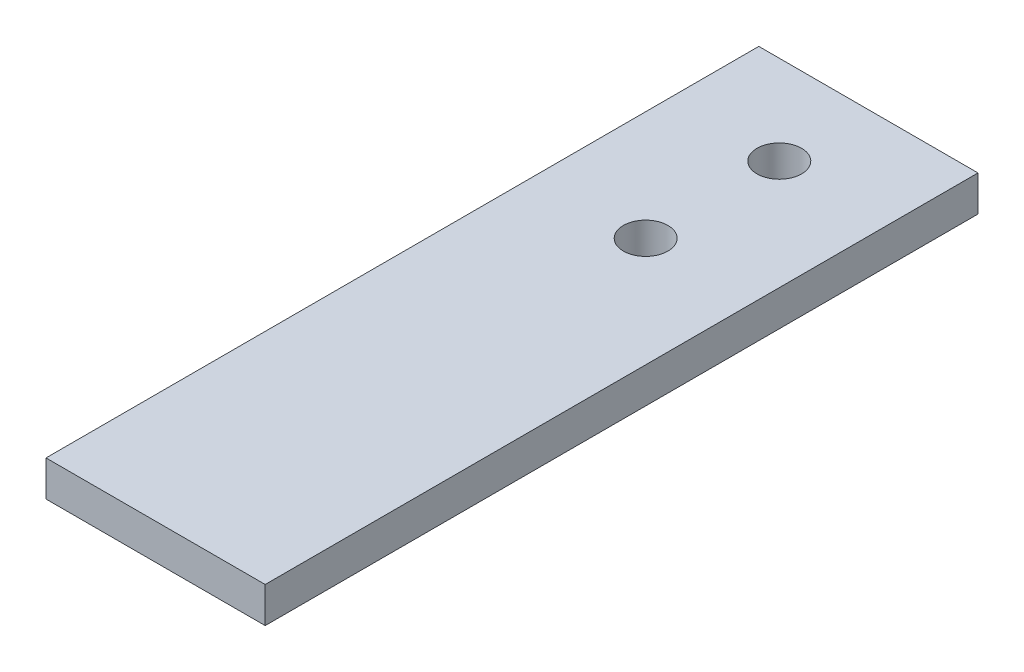
ISO-10303-21;
HEADER;
FILE_DESCRIPTION(('STEP AP214'),'2;1');
FILE_NAME('part.step','',(''),(''),'','','');
FILE_SCHEMA(('AUTOMOTIVE_DESIGN { 1 0 10303 214 1 1 1 1 }'));
ENDSEC;
DATA;
#1=APPLICATION_CONTEXT('core data for automotive mechanical design processes');
#2=APPLICATION_PROTOCOL_DEFINITION('international standard','automotive_design',2000,#1);
#3=PRODUCT_CONTEXT('',#1,'mechanical');
#4=PRODUCT('Part','Part','',(#3));
#5=PRODUCT_RELATED_PRODUCT_CATEGORY('part','',(#4));
#6=PRODUCT_DEFINITION_FORMATION('','',#4);
#7=PRODUCT_DEFINITION_CONTEXT('part definition',#1,'design');
#8=PRODUCT_DEFINITION('design','',#6,#7);
#9=PRODUCT_DEFINITION_SHAPE('','',#8);
#10=(LENGTH_UNIT() NAMED_UNIT(*) SI_UNIT(.MILLI.,.METRE.));
#11=(NAMED_UNIT(*) PLANE_ANGLE_UNIT() SI_UNIT($,.RADIAN.));
#12=(NAMED_UNIT(*) SI_UNIT($,.STERADIAN.) SOLID_ANGLE_UNIT());
#13=UNCERTAINTY_MEASURE_WITH_UNIT(LENGTH_MEASURE(1.E-05),#10,'distance_accuracy_value','');
#14=(GEOMETRIC_REPRESENTATION_CONTEXT(3) GLOBAL_UNCERTAINTY_ASSIGNED_CONTEXT((#13)) GLOBAL_UNIT_ASSIGNED_CONTEXT((#10,
#11,#12)) REPRESENTATION_CONTEXT('',''));
#15=CARTESIAN_POINT('',(0.,0.,0.));
#16=DIRECTION('',(0.,0.,1.));
#17=DIRECTION('',(1.,0.,0.));
#18=AXIS2_PLACEMENT_3D('',#15,#16,#17);
#19=CARTESIAN_POINT('',(0.,5.08,0.));
#20=DIRECTION('',(1.,0.,0.));
#21=DIRECTION('',(0.,0.,-1.));
#22=AXIS2_PLACEMENT_3D('',#19,#20,#21);
#23=PLANE('',#22);
#24=DIRECTION('',(0.,0.,1.));
#25=VECTOR('',#24,1.);
#26=CARTESIAN_POINT('',(0.,0.,0.));
#27=LINE('',#26,#25);
#28=CARTESIAN_POINT('',(0.,0.,-101.6));
#29=VERTEX_POINT('',#28);
#30=CARTESIAN_POINT('',(0.,0.,0.));
#31=VERTEX_POINT('',#30);
#32=EDGE_CURVE('E111',#29,#31,#27,.T.);
#33=ORIENTED_EDGE('',*,*,#32,.T.);
#34=DIRECTION('',(0.,-1.,0.));
#35=VECTOR('',#34,1.);
#36=CARTESIAN_POINT('',(0.,5.08,0.));
#37=LINE('',#36,#35);
#38=CARTESIAN_POINT('',(0.,5.08,0.));
#39=VERTEX_POINT('',#38);
#40=EDGE_CURVE('E11',#39,#31,#37,.T.);
#41=ORIENTED_EDGE('',*,*,#40,.F.);
#42=DIRECTION('',(0.,0.,1.));
#43=VECTOR('',#42,1.);
#44=CARTESIAN_POINT('',(0.,5.08,0.));
#45=LINE('',#44,#43);
#46=CARTESIAN_POINT('',(0.,5.08,-101.6));
#47=VERTEX_POINT('',#46);
#48=EDGE_CURVE('E95',#47,#39,#45,.T.);
#49=ORIENTED_EDGE('',*,*,#48,.F.);
#50=DIRECTION('',(0.,-1.,0.));
#51=VECTOR('',#50,1.);
#52=CARTESIAN_POINT('',(0.,5.08,-101.6));
#53=LINE('',#52,#51);
#54=EDGE_CURVE('E107',#47,#29,#53,.T.);
#55=ORIENTED_EDGE('',*,*,#54,.T.);
#56=EDGE_LOOP('',(#33,#41,#49,#55));
#57=FACE_BOUND('',#56,.T.);
#58=ADVANCED_FACE('F43',(#57),#23,.F.);
#59=CARTESIAN_POINT('',(0.,5.08,0.));
#60=DIRECTION('',(0.,0.,-1.));
#61=DIRECTION('',(-1.,0.,0.));
#62=AXIS2_PLACEMENT_3D('',#59,#60,#61);
#63=PLANE('',#62);
#64=DIRECTION('',(1.,0.,0.));
#65=VECTOR('',#64,1.);
#66=CARTESIAN_POINT('',(0.,0.,0.));
#67=LINE('',#66,#65);
#68=CARTESIAN_POINT('',(31.242,0.,0.));
#69=VERTEX_POINT('',#68);
#70=EDGE_CURVE('E100',#31,#69,#67,.T.);
#71=ORIENTED_EDGE('',*,*,#70,.T.);
#72=DIRECTION('',(0.,-1.,0.));
#73=VECTOR('',#72,1.);
#74=CARTESIAN_POINT('',(31.242,5.08,0.));
#75=LINE('',#74,#73);
#76=CARTESIAN_POINT('',(31.242,5.08,0.));
#77=VERTEX_POINT('',#76);
#78=EDGE_CURVE('E52',#77,#69,#75,.T.);
#79=ORIENTED_EDGE('',*,*,#78,.F.);
#80=DIRECTION('',(1.,0.,0.));
#81=VECTOR('',#80,1.);
#82=CARTESIAN_POINT('',(0.,5.08,0.));
#83=LINE('',#82,#81);
#84=EDGE_CURVE('E90',#39,#77,#83,.T.);
#85=ORIENTED_EDGE('',*,*,#84,.F.);
#86=ORIENTED_EDGE('',*,*,#40,.T.);
#87=EDGE_LOOP('',(#71,#79,#85,#86));
#88=FACE_BOUND('',#87,.T.);
#89=ADVANCED_FACE('F99',(#88),#63,.F.);
#90=CARTESIAN_POINT('',(31.242,5.08,0.));
#91=DIRECTION('',(-1.,0.,0.));
#92=DIRECTION('',(0.,0.,1.));
#93=AXIS2_PLACEMENT_3D('',#90,#91,#92);
#94=PLANE('',#93);
#95=DIRECTION('',(0.,0.,-1.));
#96=VECTOR('',#95,1.);
#97=CARTESIAN_POINT('',(31.242,0.,0.));
#98=LINE('',#97,#96);
#99=CARTESIAN_POINT('',(31.242,0.,-101.6));
#100=VERTEX_POINT('',#99);
#101=EDGE_CURVE('E77',#69,#100,#98,.T.);
#102=ORIENTED_EDGE('',*,*,#101,.T.);
#103=DIRECTION('',(0.,-1.,0.));
#104=VECTOR('',#103,1.);
#105=CARTESIAN_POINT('',(31.242,5.08,-101.6));
#106=LINE('',#105,#104);
#107=CARTESIAN_POINT('',(31.242,5.08,-101.6));
#108=VERTEX_POINT('',#107);
#109=EDGE_CURVE('E102',#108,#100,#106,.T.);
#110=ORIENTED_EDGE('',*,*,#109,.F.);
#111=DIRECTION('',(0.,0.,-1.));
#112=VECTOR('',#111,1.);
#113=CARTESIAN_POINT('',(31.242,5.08,0.));
#114=LINE('',#113,#112);
#115=EDGE_CURVE('E93',#77,#108,#114,.T.);
#116=ORIENTED_EDGE('',*,*,#115,.F.);
#117=ORIENTED_EDGE('',*,*,#78,.T.);
#118=EDGE_LOOP('',(#102,#110,#116,#117));
#119=FACE_BOUND('',#118,.T.);
#120=ADVANCED_FACE('F103',(#119),#94,.F.);
#121=CARTESIAN_POINT('',(0.,5.08,-101.6));
#122=DIRECTION('',(0.,0.,1.));
#123=DIRECTION('',(1.,0.,0.));
#124=AXIS2_PLACEMENT_3D('',#121,#122,#123);
#125=PLANE('',#124);
#126=DIRECTION('',(-1.,0.,0.));
#127=VECTOR('',#126,1.);
#128=CARTESIAN_POINT('',(0.,0.,-101.6));
#129=LINE('',#128,#127);
#130=EDGE_CURVE('E83',#100,#29,#129,.T.);
#131=ORIENTED_EDGE('',*,*,#130,.T.);
#132=ORIENTED_EDGE('',*,*,#54,.F.);
#133=DIRECTION('',(-1.,0.,0.));
#134=VECTOR('',#133,1.);
#135=CARTESIAN_POINT('',(0.,5.08,-101.6));
#136=LINE('',#135,#134);
#137=EDGE_CURVE('E60',#108,#47,#136,.T.);
#138=ORIENTED_EDGE('',*,*,#137,.F.);
#139=ORIENTED_EDGE('',*,*,#109,.T.);
#140=EDGE_LOOP('',(#131,#132,#138,#139));
#141=FACE_BOUND('',#140,.T.);
#142=ADVANCED_FACE('F125',(#141),#125,.F.);
#143=CARTESIAN_POINT('',(0.,5.08,0.));
#144=DIRECTION('',(0.,-1.,0.));
#145=DIRECTION('',(0.,0.,-1.));
#146=AXIS2_PLACEMENT_3D('',#143,#144,#145);
#147=PLANE('',#146);
#148=CARTESIAN_POINT('',(15.621,5.08,-69.85));
#149=DIRECTION('',(0.,-1.,0.));
#150=DIRECTION('',(0.,0.,-1.));
#151=AXIS2_PLACEMENT_3D('',#148,#149,#150);
#152=CIRCLE('',#151,3.17499999999999);
#153=CARTESIAN_POINT('',(15.621,5.08,-73.025));
#154=VERTEX_POINT('',#153);
#155=EDGE_CURVE('E139',#154,#154,#152,.T.);
#156=ORIENTED_EDGE('',*,*,#155,.T.);
#157=EDGE_LOOP('',(#156));
#158=FACE_BOUND('',#157,.T.);
#159=CARTESIAN_POINT('',(15.621,5.08,-88.9));
#160=DIRECTION('',(0.,-1.,0.));
#161=DIRECTION('',(0.,0.,-1.));
#162=AXIS2_PLACEMENT_3D('',#159,#160,#161);
#163=CIRCLE('',#162,3.17499999999999);
#164=CARTESIAN_POINT('',(15.621,5.08,-92.075));
#165=VERTEX_POINT('',#164);
#166=EDGE_CURVE('E115',#165,#165,#163,.T.);
#167=ORIENTED_EDGE('',*,*,#166,.T.);
#168=EDGE_LOOP('',(#167));
#169=FACE_BOUND('',#168,.T.);
#170=ORIENTED_EDGE('',*,*,#48,.T.);
#171=ORIENTED_EDGE('',*,*,#84,.T.);
#172=ORIENTED_EDGE('',*,*,#115,.T.);
#173=ORIENTED_EDGE('',*,*,#137,.T.);
#174=EDGE_LOOP('',(#170,#171,#172,#173));
#175=FACE_BOUND('',#174,.T.);
#176=ADVANCED_FACE('F91',(#158,#169,#175),#147,.F.);
#177=CARTESIAN_POINT('',(0.,0.,0.));
#178=DIRECTION('',(0.,-1.,0.));
#179=DIRECTION('',(0.,0.,-1.));
#180=AXIS2_PLACEMENT_3D('',#177,#178,#179);
#181=PLANE('',#180);
#182=CARTESIAN_POINT('',(15.621,0.,-69.85));
#183=DIRECTION('',(0.,-1.,0.));
#184=DIRECTION('',(0.,0.,-1.));
#185=AXIS2_PLACEMENT_3D('',#182,#183,#184);
#186=CIRCLE('',#185,3.17499999999999);
#187=CARTESIAN_POINT('',(15.621,0.,-73.025));
#188=VERTEX_POINT('',#187);
#189=EDGE_CURVE('E143',#188,#188,#186,.T.);
#190=ORIENTED_EDGE('',*,*,#189,.F.);
#191=EDGE_LOOP('',(#190));
#192=FACE_BOUND('',#191,.T.);
#193=CARTESIAN_POINT('',(15.621,0.,-88.9));
#194=DIRECTION('',(0.,-1.,0.));
#195=DIRECTION('',(0.,0.,-1.));
#196=AXIS2_PLACEMENT_3D('',#193,#194,#195);
#197=CIRCLE('',#196,3.17499999999999);
#198=CARTESIAN_POINT('',(15.621,0.,-92.075));
#199=VERTEX_POINT('',#198);
#200=EDGE_CURVE('E135',#199,#199,#197,.T.);
#201=ORIENTED_EDGE('',*,*,#200,.F.);
#202=EDGE_LOOP('',(#201));
#203=FACE_BOUND('',#202,.T.);
#204=ORIENTED_EDGE('',*,*,#32,.F.);
#205=ORIENTED_EDGE('',*,*,#130,.F.);
#206=ORIENTED_EDGE('',*,*,#101,.F.);
#207=ORIENTED_EDGE('',*,*,#70,.F.);
#208=EDGE_LOOP('',(#204,#205,#206,#207));
#209=FACE_BOUND('',#208,.T.);
#210=ADVANCED_FACE('F128',(#192,#203,#209),#181,.T.);
#211=CARTESIAN_POINT('',(15.621,0.,-88.9));
#212=DIRECTION('',(0.,-1.,0.));
#213=DIRECTION('',(0.,0.,-1.));
#214=AXIS2_PLACEMENT_3D('',#211,#212,#213);
#215=CYLINDRICAL_SURFACE('',#214,3.17499999999999);
#216=ORIENTED_EDGE('',*,*,#166,.F.);
#217=EDGE_LOOP('',(#216));
#218=FACE_BOUND('',#217,.T.);
#219=ORIENTED_EDGE('',*,*,#200,.T.);
#220=EDGE_LOOP('',(#219));
#221=FACE_BOUND('',#220,.T.);
#222=ADVANCED_FACE('F152',(#218,#221),#215,.F.);
#223=CARTESIAN_POINT('',(15.621,0.,-69.85));
#224=DIRECTION('',(0.,-1.,0.));
#225=DIRECTION('',(0.,0.,-1.));
#226=AXIS2_PLACEMENT_3D('',#223,#224,#225);
#227=CYLINDRICAL_SURFACE('',#226,3.17499999999999);
#228=ORIENTED_EDGE('',*,*,#155,.F.);
#229=EDGE_LOOP('',(#228));
#230=FACE_BOUND('',#229,.T.);
#231=ORIENTED_EDGE('',*,*,#189,.T.);
#232=EDGE_LOOP('',(#231));
#233=FACE_BOUND('',#232,.T.);
#234=ADVANCED_FACE('F148',(#230,#233),#227,.F.);
#235=CLOSED_SHELL('',(#58,#89,#120,#142,#176,#210,#222,#234));
#236=MANIFOLD_SOLID_BREP('B2',#235);
#237=ADVANCED_BREP_SHAPE_REPRESENTATION('',(#18,#236),#14);
#238=SHAPE_DEFINITION_REPRESENTATION(#9,#237);
ENDSEC;
END-ISO-10303-21;
